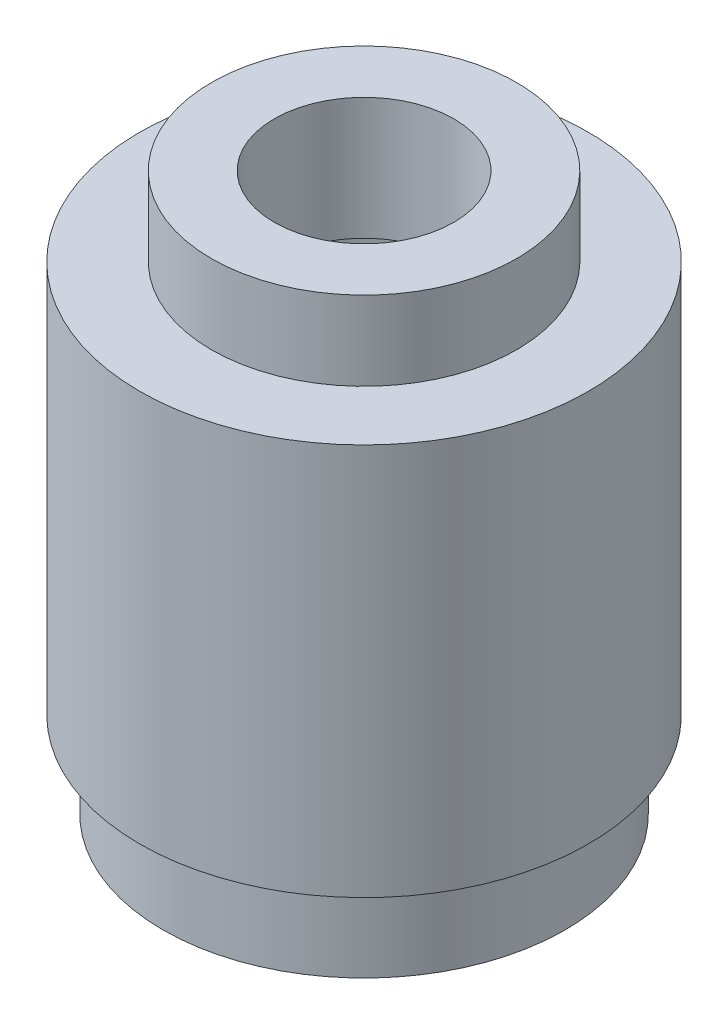
ISO-10303-21;
HEADER;
FILE_DESCRIPTION(('STEP AP214'),'2;1');
FILE_NAME('part.step','',(''),(''),'','','');
FILE_SCHEMA(('AUTOMOTIVE_DESIGN { 1 0 10303 214 1 1 1 1 }'));
ENDSEC;
DATA;
#1=APPLICATION_CONTEXT('core data for automotive mechanical design processes');
#2=APPLICATION_PROTOCOL_DEFINITION('international standard','automotive_design',2000,#1);
#3=PRODUCT_CONTEXT('',#1,'mechanical');
#4=PRODUCT('Part','Part','',(#3));
#5=PRODUCT_RELATED_PRODUCT_CATEGORY('part','',(#4));
#6=PRODUCT_DEFINITION_FORMATION('','',#4);
#7=PRODUCT_DEFINITION_CONTEXT('part definition',#1,'design');
#8=PRODUCT_DEFINITION('design','',#6,#7);
#9=PRODUCT_DEFINITION_SHAPE('','',#8);
#10=(LENGTH_UNIT() NAMED_UNIT(*) SI_UNIT(.MILLI.,.METRE.));
#11=(NAMED_UNIT(*) PLANE_ANGLE_UNIT() SI_UNIT($,.RADIAN.));
#12=(NAMED_UNIT(*) SI_UNIT($,.STERADIAN.) SOLID_ANGLE_UNIT());
#13=UNCERTAINTY_MEASURE_WITH_UNIT(LENGTH_MEASURE(1.E-05),#10,'distance_accuracy_value','');
#14=(GEOMETRIC_REPRESENTATION_CONTEXT(3) GLOBAL_UNCERTAINTY_ASSIGNED_CONTEXT((#13)) GLOBAL_UNIT_ASSIGNED_CONTEXT((#10,
#11,#12)) REPRESENTATION_CONTEXT('',''));
#15=CARTESIAN_POINT('',(0.,0.,0.));
#16=DIRECTION('',(0.,0.,1.));
#17=DIRECTION('',(1.,0.,0.));
#18=AXIS2_PLACEMENT_3D('',#15,#16,#17);
#19=CARTESIAN_POINT('',(2.69875000000001,-4.2291,0.));
#20=DIRECTION('',(0.,1.,0.));
#21=DIRECTION('',(0.,0.,1.));
#22=AXIS2_PLACEMENT_3D('',#19,#20,#21);
#23=PLANE('',#22);
#24=CARTESIAN_POINT('',(0.,-4.2291,0.));
#25=DIRECTION('',(0.,1.,0.));
#26=DIRECTION('',(0.,0.,1.));
#27=AXIS2_PLACEMENT_3D('',#24,#25,#26);
#28=CIRCLE('',#27,3.55600000000001);
#29=CARTESIAN_POINT('',(0.,-4.2291,3.55600000000001));
#30=VERTEX_POINT('',#29);
#31=EDGE_CURVE('E12',#30,#30,#28,.T.);
#32=ORIENTED_EDGE('',*,*,#31,.F.);
#33=EDGE_LOOP('',(#32));
#34=FACE_BOUND('',#33,.T.);
#35=CARTESIAN_POINT('',(0.,-4.2291,0.));
#36=DIRECTION('',(0.,1.,0.));
#37=DIRECTION('',(0.,0.,1.));
#38=AXIS2_PLACEMENT_3D('',#35,#36,#37);
#39=CIRCLE('',#38,2.69875000000001);
#40=CARTESIAN_POINT('',(0.,-4.2291,2.69875000000001));
#41=VERTEX_POINT('',#40);
#42=EDGE_CURVE('E96',#41,#41,#39,.T.);
#43=ORIENTED_EDGE('',*,*,#42,.T.);
#44=EDGE_LOOP('',(#43));
#45=FACE_BOUND('',#44,.T.);
#46=ADVANCED_FACE('F45',(#34,#45),#23,.F.);
#47=CARTESIAN_POINT('',(0.,42.2943462373149,0.));
#48=DIRECTION('',(0.,1.,0.));
#49=DIRECTION('',(0.,0.,1.));
#50=AXIS2_PLACEMENT_3D('',#47,#48,#49);
#51=CYLINDRICAL_SURFACE('',#50,3.55600000000001);
#52=CARTESIAN_POINT('',(0.,-2.7051,0.));
#53=DIRECTION('',(0.,1.,0.));
#54=DIRECTION('',(0.,0.,1.));
#55=AXIS2_PLACEMENT_3D('',#52,#53,#54);
#56=CIRCLE('',#55,3.55600000000001);
#57=CARTESIAN_POINT('',(0.,-2.7051,3.55600000000001));
#58=VERTEX_POINT('',#57);
#59=EDGE_CURVE('E52',#58,#58,#56,.T.);
#60=ORIENTED_EDGE('',*,*,#59,.F.);
#61=EDGE_LOOP('',(#60));
#62=FACE_BOUND('',#61,.T.);
#63=ORIENTED_EDGE('',*,*,#31,.T.);
#64=EDGE_LOOP('',(#63));
#65=FACE_BOUND('',#64,.T.);
#66=ADVANCED_FACE('F158',(#62,#65),#51,.T.);
#67=CARTESIAN_POINT('',(3.55600000000001,-2.7051,0.));
#68=DIRECTION('',(0.,1.,0.));
#69=DIRECTION('',(0.,0.,1.));
#70=AXIS2_PLACEMENT_3D('',#67,#68,#69);
#71=PLANE('',#70);
#72=CARTESIAN_POINT('',(0.,-2.7051,0.));
#73=DIRECTION('',(0.,1.,0.));
#74=DIRECTION('',(0.,0.,1.));
#75=AXIS2_PLACEMENT_3D('',#72,#73,#74);
#76=CIRCLE('',#75,3.96875000000001);
#77=CARTESIAN_POINT('',(0.,-2.7051,3.96875000000001));
#78=VERTEX_POINT('',#77);
#79=EDGE_CURVE('E58',#78,#78,#76,.T.);
#80=ORIENTED_EDGE('',*,*,#79,.F.);
#81=EDGE_LOOP('',(#80));
#82=FACE_BOUND('',#81,.T.);
#83=ORIENTED_EDGE('',*,*,#59,.T.);
#84=EDGE_LOOP('',(#83));
#85=FACE_BOUND('',#84,.T.);
#86=ADVANCED_FACE('F153',(#82,#85),#71,.F.);
#87=CARTESIAN_POINT('',(0.,42.2943462373149,0.));
#88=DIRECTION('',(0.,1.,0.));
#89=DIRECTION('',(0.,0.,1.));
#90=AXIS2_PLACEMENT_3D('',#87,#88,#89);
#91=CYLINDRICAL_SURFACE('',#90,3.96875000000001);
#92=CARTESIAN_POINT('',(0.,4.2291,0.));
#93=DIRECTION('',(0.,1.,0.));
#94=DIRECTION('',(0.,0.,1.));
#95=AXIS2_PLACEMENT_3D('',#92,#93,#94);
#96=CIRCLE('',#95,3.96875000000001);
#97=CARTESIAN_POINT('',(0.,4.2291,3.96875000000001));
#98=VERTEX_POINT('',#97);
#99=EDGE_CURVE('E64',#98,#98,#96,.T.);
#100=ORIENTED_EDGE('',*,*,#99,.F.);
#101=EDGE_LOOP('',(#100));
#102=FACE_BOUND('',#101,.T.);
#103=ORIENTED_EDGE('',*,*,#79,.T.);
#104=EDGE_LOOP('',(#103));
#105=FACE_BOUND('',#104,.T.);
#106=ADVANCED_FACE('F147',(#102,#105),#91,.T.);
#107=CARTESIAN_POINT('',(3.96875000000001,4.2291,0.));
#108=DIRECTION('',(0.,-1.,0.));
#109=DIRECTION('',(0.,0.,-1.));
#110=AXIS2_PLACEMENT_3D('',#107,#108,#109);
#111=PLANE('',#110);
#112=CARTESIAN_POINT('',(0.,4.2291,0.));
#113=DIRECTION('',(0.,1.,0.));
#114=DIRECTION('',(0.,0.,1.));
#115=AXIS2_PLACEMENT_3D('',#112,#113,#114);
#116=CIRCLE('',#115,2.69875);
#117=CARTESIAN_POINT('',(0.,4.2291,2.69875000000001));
#118=VERTEX_POINT('',#117);
#119=EDGE_CURVE('E69',#118,#118,#116,.T.);
#120=ORIENTED_EDGE('',*,*,#119,.F.);
#121=EDGE_LOOP('',(#120));
#122=FACE_BOUND('',#121,.T.);
#123=ORIENTED_EDGE('',*,*,#99,.T.);
#124=EDGE_LOOP('',(#123));
#125=FACE_BOUND('',#124,.T.);
#126=ADVANCED_FACE('F141',(#122,#125),#111,.F.);
#127=CARTESIAN_POINT('',(0.,42.2943462373149,0.));
#128=DIRECTION('',(0.,1.,0.));
#129=DIRECTION('',(0.,0.,1.));
#130=AXIS2_PLACEMENT_3D('',#127,#128,#129);
#131=CYLINDRICAL_SURFACE('',#130,2.69875);
#132=CARTESIAN_POINT('',(0.,5.6261,0.));
#133=DIRECTION('',(0.,1.,0.));
#134=DIRECTION('',(0.,0.,1.));
#135=AXIS2_PLACEMENT_3D('',#132,#133,#134);
#136=CIRCLE('',#135,2.69875);
#137=CARTESIAN_POINT('',(0.,5.6261,2.69875000000001));
#138=VERTEX_POINT('',#137);
#139=EDGE_CURVE('E73',#138,#138,#136,.T.);
#140=ORIENTED_EDGE('',*,*,#139,.F.);
#141=EDGE_LOOP('',(#140));
#142=FACE_BOUND('',#141,.T.);
#143=ORIENTED_EDGE('',*,*,#119,.T.);
#144=EDGE_LOOP('',(#143));
#145=FACE_BOUND('',#144,.T.);
#146=ADVANCED_FACE('F135',(#142,#145),#131,.T.);
#147=CARTESIAN_POINT('',(2.69875,5.6261,0.));
#148=DIRECTION('',(0.,-1.,0.));
#149=DIRECTION('',(0.,0.,-1.));
#150=AXIS2_PLACEMENT_3D('',#147,#148,#149);
#151=PLANE('',#150);
#152=CARTESIAN_POINT('',(0.,5.6261,0.));
#153=DIRECTION('',(0.,1.,0.));
#154=DIRECTION('',(0.,0.,1.));
#155=AXIS2_PLACEMENT_3D('',#152,#153,#154);
#156=CIRCLE('',#155,1.5875);
#157=CARTESIAN_POINT('',(0.,5.6261,1.58750000000001));
#158=VERTEX_POINT('',#157);
#159=EDGE_CURVE('E77',#158,#158,#156,.T.);
#160=ORIENTED_EDGE('',*,*,#159,.F.);
#161=EDGE_LOOP('',(#160));
#162=FACE_BOUND('',#161,.T.);
#163=ORIENTED_EDGE('',*,*,#139,.T.);
#164=EDGE_LOOP('',(#163));
#165=FACE_BOUND('',#164,.T.);
#166=ADVANCED_FACE('F129',(#162,#165),#151,.F.);
#167=CARTESIAN_POINT('',(0.,42.2943462373149,0.));
#168=DIRECTION('',(0.,1.,0.));
#169=DIRECTION('',(0.,0.,1.));
#170=AXIS2_PLACEMENT_3D('',#167,#168,#169);
#171=CYLINDRICAL_SURFACE('',#170,1.5875);
#172=CARTESIAN_POINT('',(0.,3.4671,0.));
#173=DIRECTION('',(0.,1.,0.));
#174=DIRECTION('',(0.,0.,1.));
#175=AXIS2_PLACEMENT_3D('',#172,#173,#174);
#176=CIRCLE('',#175,1.5875);
#177=CARTESIAN_POINT('',(0.,3.4671,1.5875));
#178=VERTEX_POINT('',#177);
#179=EDGE_CURVE('E81',#178,#178,#176,.T.);
#180=ORIENTED_EDGE('',*,*,#179,.F.);
#181=EDGE_LOOP('',(#180));
#182=FACE_BOUND('',#181,.T.);
#183=ORIENTED_EDGE('',*,*,#159,.T.);
#184=EDGE_LOOP('',(#183));
#185=FACE_BOUND('',#184,.T.);
#186=ADVANCED_FACE('F123',(#182,#185),#171,.F.);
#187=CARTESIAN_POINT('',(1.58750000000001,3.4671,0.));
#188=DIRECTION('',(0.,1.,0.));
#189=DIRECTION('',(0.,0.,1.));
#190=AXIS2_PLACEMENT_3D('',#187,#188,#189);
#191=PLANE('',#190);
#192=CARTESIAN_POINT('',(0.,3.4671,0.));
#193=DIRECTION('',(0.,1.,0.));
#194=DIRECTION('',(0.,0.,1.));
#195=AXIS2_PLACEMENT_3D('',#192,#193,#194);
#196=CIRCLE('',#195,3.46075000000001);
#197=CARTESIAN_POINT('',(0.,3.4671,3.46075000000001));
#198=VERTEX_POINT('',#197);
#199=EDGE_CURVE('E85',#198,#198,#196,.T.);
#200=ORIENTED_EDGE('',*,*,#199,.F.);
#201=EDGE_LOOP('',(#200));
#202=FACE_BOUND('',#201,.T.);
#203=ORIENTED_EDGE('',*,*,#179,.T.);
#204=EDGE_LOOP('',(#203));
#205=FACE_BOUND('',#204,.T.);
#206=ADVANCED_FACE('F117',(#202,#205),#191,.F.);
#207=CARTESIAN_POINT('',(0.,42.2943462373149,0.));
#208=DIRECTION('',(0.,1.,0.));
#209=DIRECTION('',(0.,0.,1.));
#210=AXIS2_PLACEMENT_3D('',#207,#208,#209);
#211=CYLINDRICAL_SURFACE('',#210,3.46075000000001);
#212=CARTESIAN_POINT('',(0.,-1.9431,0.));
#213=DIRECTION('',(0.,1.,0.));
#214=DIRECTION('',(0.,0.,1.));
#215=AXIS2_PLACEMENT_3D('',#212,#213,#214);
#216=CIRCLE('',#215,3.46075000000001);
#217=CARTESIAN_POINT('',(0.,-1.9431,3.46075000000001));
#218=VERTEX_POINT('',#217);
#219=EDGE_CURVE('E89',#218,#218,#216,.T.);
#220=ORIENTED_EDGE('',*,*,#219,.F.);
#221=EDGE_LOOP('',(#220));
#222=FACE_BOUND('',#221,.T.);
#223=ORIENTED_EDGE('',*,*,#199,.T.);
#224=EDGE_LOOP('',(#223));
#225=FACE_BOUND('',#224,.T.);
#226=ADVANCED_FACE('F111',(#222,#225),#211,.F.);
#227=CARTESIAN_POINT('',(2.69875000000001,-1.9431,0.));
#228=DIRECTION('',(0.,-1.,0.));
#229=DIRECTION('',(0.,0.,-1.));
#230=AXIS2_PLACEMENT_3D('',#227,#228,#229);
#231=PLANE('',#230);
#232=CARTESIAN_POINT('',(0.,-1.9431,0.));
#233=DIRECTION('',(0.,1.,0.));
#234=DIRECTION('',(0.,0.,1.));
#235=AXIS2_PLACEMENT_3D('',#232,#233,#234);
#236=CIRCLE('',#235,2.69875000000001);
#237=CARTESIAN_POINT('',(0.,-1.9431,2.69875000000002));
#238=VERTEX_POINT('',#237);
#239=EDGE_CURVE('E92',#238,#238,#236,.T.);
#240=ORIENTED_EDGE('',*,*,#239,.F.);
#241=EDGE_LOOP('',(#240));
#242=FACE_BOUND('',#241,.T.);
#243=ORIENTED_EDGE('',*,*,#219,.T.);
#244=EDGE_LOOP('',(#243));
#245=FACE_BOUND('',#244,.T.);
#246=ADVANCED_FACE('F105',(#242,#245),#231,.F.);
#247=CARTESIAN_POINT('',(0.,42.2943462373149,0.));
#248=DIRECTION('',(0.,1.,0.));
#249=DIRECTION('',(0.,0.,1.));
#250=AXIS2_PLACEMENT_3D('',#247,#248,#249);
#251=CYLINDRICAL_SURFACE('',#250,2.69875000000001);
#252=ORIENTED_EDGE('',*,*,#42,.F.);
#253=EDGE_LOOP('',(#252));
#254=FACE_BOUND('',#253,.T.);
#255=ORIENTED_EDGE('',*,*,#239,.T.);
#256=EDGE_LOOP('',(#255));
#257=FACE_BOUND('',#256,.T.);
#258=ADVANCED_FACE('F102',(#254,#257),#251,.F.);
#259=CLOSED_SHELL('',(#46,#66,#86,#106,#126,#146,#166,#186,#206,#226,#246,#258));
#260=MANIFOLD_SOLID_BREP('B2',#259);
#261=ADVANCED_BREP_SHAPE_REPRESENTATION('',(#18,#260),#14);
#262=SHAPE_DEFINITION_REPRESENTATION(#9,#261);
ENDSEC;
END-ISO-10303-21;
